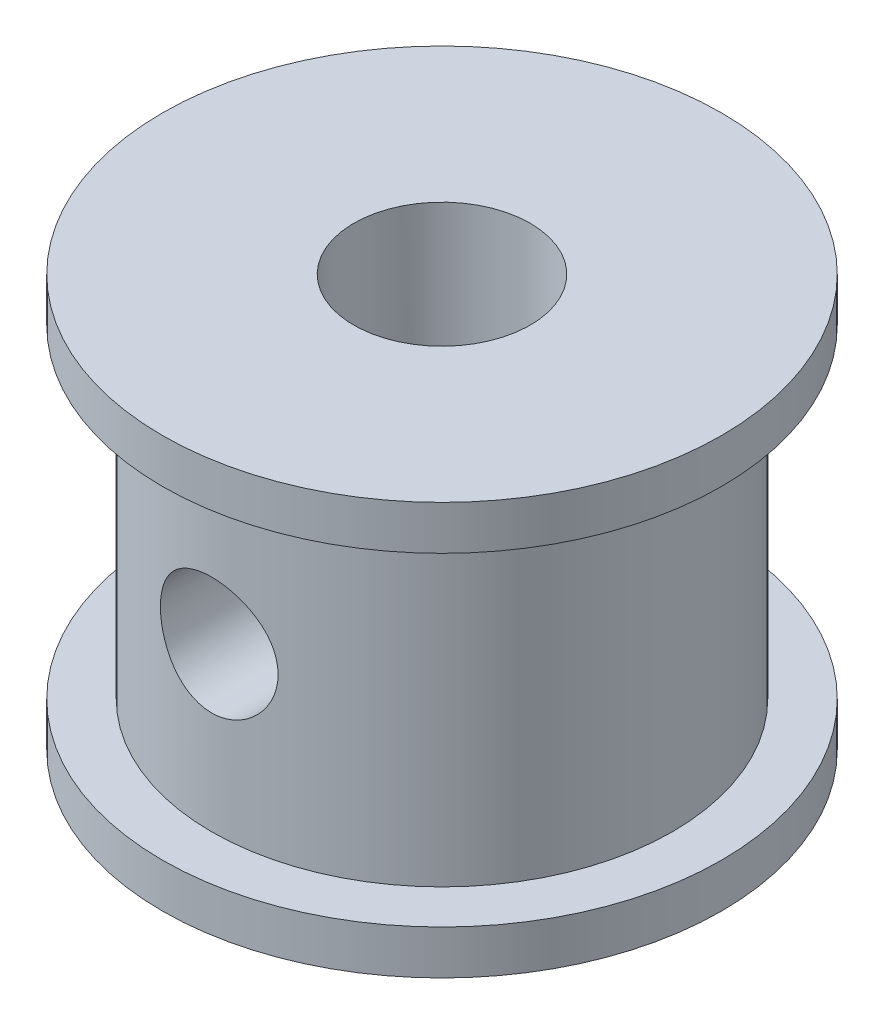
ISO-10303-21;
HEADER;
FILE_DESCRIPTION(('STEP AP214'),'2;1');
FILE_NAME('part.step','',(''),(''),'','','');
FILE_SCHEMA(('AUTOMOTIVE_DESIGN { 1 0 10303 214 1 1 1 1 }'));
ENDSEC;
DATA;
#1=APPLICATION_CONTEXT('core data for automotive mechanical design processes');
#2=APPLICATION_PROTOCOL_DEFINITION('international standard','automotive_design',2000,#1);
#3=PRODUCT_CONTEXT('',#1,'mechanical');
#4=PRODUCT('Part','Part','',(#3));
#5=PRODUCT_RELATED_PRODUCT_CATEGORY('part','',(#4));
#6=PRODUCT_DEFINITION_FORMATION('','',#4);
#7=PRODUCT_DEFINITION_CONTEXT('part definition',#1,'design');
#8=PRODUCT_DEFINITION('design','',#6,#7);
#9=PRODUCT_DEFINITION_SHAPE('','',#8);
#10=(LENGTH_UNIT() NAMED_UNIT(*) SI_UNIT(.MILLI.,.METRE.));
#11=(NAMED_UNIT(*) PLANE_ANGLE_UNIT() SI_UNIT($,.RADIAN.));
#12=(NAMED_UNIT(*) SI_UNIT($,.STERADIAN.) SOLID_ANGLE_UNIT());
#13=UNCERTAINTY_MEASURE_WITH_UNIT(LENGTH_MEASURE(1.E-05),#10,'distance_accuracy_value','');
#14=(GEOMETRIC_REPRESENTATION_CONTEXT(3) GLOBAL_UNCERTAINTY_ASSIGNED_CONTEXT((#13)) GLOBAL_UNIT_ASSIGNED_CONTEXT((#10,
#11,#12)) REPRESENTATION_CONTEXT('',''));
#15=CARTESIAN_POINT('',(0.,0.,0.));
#16=DIRECTION('',(0.,0.,1.));
#17=DIRECTION('',(1.,0.,0.));
#18=AXIS2_PLACEMENT_3D('',#15,#16,#17);
#19=CARTESIAN_POINT('',(0.,-5.5,0.));
#20=DIRECTION('',(0.,1.,0.));
#21=DIRECTION('',(0.,0.,1.));
#22=AXIS2_PLACEMENT_3D('',#19,#20,#21);
#23=CYLINDRICAL_SURFACE('',#22,7.83);
#24=CARTESIAN_POINT('',(-7.57026419618232,0.,-2.));
#25=CARTESIAN_POINT('',(-7.57026625113137,-0.110356362794923,-1.99999700894322));
#26=CARTESIAN_POINT('',(-7.57270365498595,-0.220745347586535,-1.99083498998717));
#27=CARTESIAN_POINT('',(-7.58216366301143,-0.43834755404925,-1.95449092309336));
#28=CARTESIAN_POINT('',(-7.58918881736881,-0.545558974741733,-1.92729885268692));
#29=CARTESIAN_POINT('',(-7.60697794193006,-0.753626988633069,-1.8558368642648));
#30=CARTESIAN_POINT('',(-7.61773694696175,-0.854491811990421,-1.81158961715049));
#31=CARTESIAN_POINT('',(-7.64177527659829,-1.04737918807853,-1.70734299084561));
#32=CARTESIAN_POINT('',(-7.655054736864,-1.13940126445593,-1.64734276370074));
#33=CARTESIAN_POINT('',(-7.68297919650331,-1.31410409338048,-1.51182113810645));
#34=CARTESIAN_POINT('',(-7.69764678771056,-1.39655180338595,-1.43600391649795));
#35=CARTESIAN_POINT('',(-7.72649917806867,-1.547710204927,-1.27163734975208));
#36=CARTESIAN_POINT('',(-7.7406839304431,-1.61641956864515,-1.18308677535091));
#37=CARTESIAN_POINT('',(-7.76722304596379,-1.73911017484842,-0.994164404656442));
#38=CARTESIAN_POINT('',(-7.77954764342751,-1.79286160366153,-0.89363881835594));
#39=CARTESIAN_POINT('',(-7.80071959024948,-1.88261483706627,-0.684611141346791));
#40=CARTESIAN_POINT('',(-7.80956747587152,-1.91861937923627,-0.576110283847273));
#41=CARTESIAN_POINT('',(-7.82262936162777,-1.9711078733964,-0.356642468206245));
#42=CARTESIAN_POINT('',(-7.82693722332135,-1.98798778902362,-0.245775893025707));
#43=CARTESIAN_POINT('',(-7.83076111416367,-2.00299169306133,-0.0227064617364563));
#44=CARTESIAN_POINT('',(-7.83027788161392,-2.00111857129053,0.0894961858236682));
#45=CARTESIAN_POINT('',(-7.82464355122231,-1.97895246070846,0.309303374265251));
#46=CARTESIAN_POINT('',(-7.81960080046056,-1.95908700229542,0.416954225950234));
#47=CARTESIAN_POINT('',(-7.80554073651134,-1.90218844093851,0.627340728428714));
#48=CARTESIAN_POINT('',(-7.79652320667821,-1.86515440221406,0.730076110965761));
#49=CARTESIAN_POINT('',(-7.77536266643169,-1.77462988562932,0.928830578034148));
#50=CARTESIAN_POINT('',(-7.76319127679051,-1.7209890745182,1.0247780464016));
#51=CARTESIAN_POINT('',(-7.73704048634229,-1.5988881379628,1.20645822430819));
#52=CARTESIAN_POINT('',(-7.72306075891494,-1.53042533387514,1.29218908314513));
#53=CARTESIAN_POINT('',(-7.69434843791771,-1.37833900716413,1.4535529698114));
#54=CARTESIAN_POINT('',(-7.67960573170857,-1.29434209894546,1.52883266865154));
#55=CARTESIAN_POINT('',(-7.65138851063657,-1.11476239320487,1.66431868164877));
#56=CARTESIAN_POINT('',(-7.63791406054161,-1.01917900454879,1.72452422625223));
#57=CARTESIAN_POINT('',(-7.61372133210612,-0.818423303363618,1.82839261356447));
#58=CARTESIAN_POINT('',(-7.60301790070651,-0.713203266762768,1.87196691418658));
#59=CARTESIAN_POINT('',(-7.58576749764737,-0.496590867662067,1.94069595516282));
#60=CARTESIAN_POINT('',(-7.5792195920454,-0.385199898184937,1.96585483452483));
#61=CARTESIAN_POINT('',(-7.57121859249028,-0.162693199732289,1.99644536796081));
#62=CARTESIAN_POINT('',(-7.56963023253783,-0.0516542777283941,2.00240092256245));
#63=CARTESIAN_POINT('',(-7.57135936275847,0.169831538949728,1.99585296324565));
#64=CARTESIAN_POINT('',(-7.57467637914633,0.280278489765411,1.98335123202239));
#65=CARTESIAN_POINT('',(-7.58571256569704,0.495476583227604,1.94070375717033));
#66=CARTESIAN_POINT('',(-7.59335478927816,0.600293123045987,1.91086618248411));
#67=CARTESIAN_POINT('',(-7.61210657265173,0.803435916862879,1.83473721128827));
#68=CARTESIAN_POINT('',(-7.62321655688562,0.901761374590525,1.78844380054706));
#69=CARTESIAN_POINT('',(-7.64793455181796,1.09134180358515,1.67963125767167));
#70=CARTESIAN_POINT('',(-7.66158885703818,1.18241184367724,1.61680067856786));
#71=CARTESIAN_POINT('',(-7.68974492359963,1.35290842151294,1.4770886462555));
#72=CARTESIAN_POINT('',(-7.7042468303043,1.43233295381139,1.40020477807302));
#73=CARTESIAN_POINT('',(-7.73292484496928,1.57942291183955,1.232158191347));
#74=CARTESIAN_POINT('',(-7.74708241105036,1.6467249773604,1.14067365958324));
#75=CARTESIAN_POINT('',(-7.77308364783108,1.76501277507527,0.947398539577612));
#76=CARTESIAN_POINT('',(-7.7849274404072,1.81599936676636,0.84560849460087));
#77=CARTESIAN_POINT('',(-7.80489125353461,1.89975720235788,0.635321575362334));
#78=CARTESIAN_POINT('',(-7.8130383682787,1.93266136722444,0.526880338492071));
#79=CARTESIAN_POINT('',(-7.82480969678913,1.9797154169596,0.305770789494863));
#80=CARTESIAN_POINT('',(-7.82843482441698,1.99386909120521,0.193103336198653));
#81=CARTESIAN_POINT('',(-7.83071455077001,2.0027994386567,-0.0298529939103351));
#82=CARTESIAN_POINT('',(-7.82950643628764,1.99811129054583,-0.140119348310511));
#83=CARTESIAN_POINT('',(-7.82256178748259,1.97072225109619,-0.358238273068338));
#84=CARTESIAN_POINT('',(-7.816825398793,1.94802193904361,-0.466090920938106));
#85=CARTESIAN_POINT('',(-7.80149193176178,1.88554511522963,-0.675733939439828));
#86=CARTESIAN_POINT('',(-7.79191761067315,1.84586916971505,-0.777556053954113));
#87=CARTESIAN_POINT('',(-7.76991414489985,1.7506579863391,-0.973155920312975));
#88=CARTESIAN_POINT('',(-7.75748462683737,1.695120674035,-1.06693261784311));
#89=CARTESIAN_POINT('',(-7.73072209268023,1.56815210859897,-1.24630278120913));
#90=CARTESIAN_POINT('',(-7.71634946689868,1.49636035748154,-1.3316351516247));
#91=CARTESIAN_POINT('',(-7.68749289112827,1.33961555652626,-1.48922298315244));
#92=CARTESIAN_POINT('',(-7.67300891353901,1.25465913663091,-1.56147508551515));
#93=CARTESIAN_POINT('',(-7.64524349076823,1.07198208014858,-1.69225284257135));
#94=CARTESIAN_POINT('',(-7.63199135897533,0.97404294641367,-1.75048002337148));
#95=CARTESIAN_POINT('',(-7.60859045393782,0.769440361762994,-1.84955691760859));
#96=CARTESIAN_POINT('',(-7.5984394958896,0.662783120289493,-1.89041887296989));
#97=CARTESIAN_POINT('',(-7.58392076158657,0.463647261530005,-1.94775451036689));
#98=CARTESIAN_POINT('',(-7.57883899577284,0.37209407077878,-1.96730283198592));
#99=CARTESIAN_POINT('',(-7.57200999867679,0.187034941348459,-1.99342623576357));
#100=CARTESIAN_POINT('',(-7.57026245457262,0.0935291866941881,-2.00000253497942));
#101=CARTESIAN_POINT('',(-7.57026419618232,0.,-2.));
#102=B_SPLINE_CURVE_WITH_KNOTS('',3,(#24,#25,#26,#27,#28,#29,#30,#31,#32,#33,#34,#35,#36,#37,
#38,#39,#40,#41,#42,#43,#44,#45,#46,#47,#48,#49,#50,#51,#52,#53,#54,#55,#56,#57,#58,#59,#60,#61,
#62,#63,#64,#65,#66,#67,#68,#69,#70,#71,#72,#73,#74,#75,#76,#77,#78,#79,#80,#81,#82,#83,#84,#85,
#86,#87,#88,#89,#90,#91,#92,#93,#94,#95,#96,#97,#98,#99,#100,#101),.UNSPECIFIED.,.T.,.F.,(4,2,2,
2,2,2,2,2,2,2,2,2,2,2,2,2,2,2,2,2,2,2,2,2,2,2,2,2,2,2,2,2,2,2,2,2,2,2,4),(0.,0.330725478391877,
0.661634953359049,0.992106069473404,1.32259497789607,1.6599312030025,1.99730001606574,
2.33959717593098,2.681841517586,3.01686243570472,3.35183172832991,3.67904455186287,
4.00627521236341,4.33655931779794,4.66690316236142,5.00657140792717,5.34625699042944,
5.6877265845317,6.02911940712472,6.36111595691296,6.69308044294401,7.01931689452787,
7.34559329195001,7.67851907666667,8.01150212657251,8.35322504489832,8.69492995833985,
9.03408825973904,9.37317800854142,9.7027053749251,10.0322221438639,10.3598132611352,
10.6874472423329,11.023218664826,11.3590761847443,11.7015505549,12.0437830895401,
12.3241057349986,12.604402078858),.UNSPECIFIED.);
#103=CARTESIAN_POINT('',(-7.57026419618232,0.,-2.));
#104=VERTEX_POINT('',#103);
#105=EDGE_CURVE('E61',#104,#104,#102,.T.);
#106=ORIENTED_EDGE('',*,*,#105,.F.);
#107=EDGE_LOOP('',(#106));
#108=FACE_BOUND('',#107,.T.);
#109=CARTESIAN_POINT('',(0.,5.5,0.));
#110=DIRECTION('',(0.,1.,0.));
#111=DIRECTION('',(0.,0.,1.));
#112=AXIS2_PLACEMENT_3D('',#109,#110,#111);
#113=CIRCLE('',#112,7.83);
#114=CARTESIAN_POINT('',(0.,5.5,7.83));
#115=VERTEX_POINT('',#114);
#116=EDGE_CURVE('E10',#115,#115,#113,.T.);
#117=ORIENTED_EDGE('',*,*,#116,.F.);
#118=EDGE_LOOP('',(#117));
#119=FACE_BOUND('',#118,.T.);
#120=CARTESIAN_POINT('',(0.,-5.5,0.));
#121=DIRECTION('',(0.,1.,0.));
#122=DIRECTION('',(0.,0.,1.));
#123=AXIS2_PLACEMENT_3D('',#120,#121,#122);
#124=CIRCLE('',#123,7.83);
#125=CARTESIAN_POINT('',(0.,-5.5,7.83));
#126=VERTEX_POINT('',#125);
#127=EDGE_CURVE('E44',#126,#126,#124,.T.);
#128=ORIENTED_EDGE('',*,*,#127,.T.);
#129=EDGE_LOOP('',(#128));
#130=FACE_BOUND('',#129,.T.);
#131=CARTESIAN_POINT('',(0.,-2.,7.83));
#132=CARTESIAN_POINT('',(-0.110422630526224,-1.99999704655956,7.82999818920487));
#133=CARTESIAN_POINT('',(-0.220877805593165,-1.99082439986723,7.82764096435587));
#134=CARTESIAN_POINT('',(-0.438617308546014,-1.95443429976299,7.81846609838671));
#135=CARTESIAN_POINT('',(-0.545899893438622,-1.92720711290407,7.81164605132482));
#136=CARTESIAN_POINT('',(-0.754118857571174,-1.85564250941325,7.79429997085119));
#137=CARTESIAN_POINT('',(-0.855062861451803,-1.81132612622696,7.78377849456287));
#138=CARTESIAN_POINT('',(-1.04808443201088,-1.70691638670761,7.76014734098983));
#139=CARTESIAN_POINT('',(-1.14016160486808,-1.64682233004881,7.74703754882359));
#140=CARTESIAN_POINT('',(-1.31480866606515,-1.51120322178782,7.71933643415481));
#141=CARTESIAN_POINT('',(-1.39716150272941,-1.43540347646041,7.70472145647029));
#142=CARTESIAN_POINT('',(-1.54813496851945,-1.27111249373466,7.67581262731283));
#143=CARTESIAN_POINT('',(-1.61675397991676,-1.18261976331503,7.66151881384614));
#144=CARTESIAN_POINT('',(-1.73934469367368,-0.993754426487982,7.63463112812684));
#145=CARTESIAN_POINT('',(-1.79307139571595,-0.893218136533942,7.6220672283416));
#146=CARTESIAN_POINT('',(-1.88277603686673,-0.684167565902569,7.6004077894849));
#147=CARTESIAN_POINT('',(-1.9187569510196,-0.575654626001358,7.59131166910554));
#148=CARTESIAN_POINT('',(-1.97120392287247,-0.356123285612949,7.57786116329596));
#149=CARTESIAN_POINT('',(-1.98806129778428,-0.24520432594279,7.57341184901961));
#150=CARTESIAN_POINT('',(-2.00300192231294,-0.0220303549506709,7.56947474408108));
#151=CARTESIAN_POINT('',(-2.00108836951178,0.0902244255635169,7.56998610837919));
#152=CARTESIAN_POINT('',(-1.97885317682231,0.309866957093479,7.57582736669079));
#153=CARTESIAN_POINT('',(-1.95900011386275,0.417305918417863,7.58103459852507));
#154=CARTESIAN_POINT('',(-1.90219789718328,0.627275299053864,7.59548509286735));
#155=CARTESIAN_POINT('',(-1.86524747801098,0.729805354415284,7.60472865411942));
#156=CARTESIAN_POINT('',(-1.77490573406429,0.928291725467949,7.62632136174363));
#157=CARTESIAN_POINT('',(-1.7213462050114,1.0241679086814,7.63870203233622));
#158=CARTESIAN_POINT('',(-1.59942414067966,1.20573888597005,7.66515644555104));
#159=CARTESIAN_POINT('',(-1.53105891091145,1.29143182239409,7.67923049614403));
#160=CARTESIAN_POINT('',(-1.37904888996602,1.45288650010667,7.70800047514639));
#161=CARTESIAN_POINT('',(-1.29500928674836,1.52827593505789,7.72270243346977));
#162=CARTESIAN_POINT('',(-1.11530285181851,1.66396393604906,7.75069394211386));
#163=CARTESIAN_POINT('',(-1.01963563372873,1.72426200040944,7.76398344547215));
#164=CARTESIAN_POINT('',(-0.818843954800023,1.82820094134587,7.78772362621454));
#165=CARTESIAN_POINT('',(-0.713685701847834,1.87177914577771,7.79816358107495));
#166=CARTESIAN_POINT('',(-0.497209355913703,1.94053421509965,7.81495055954834));
#167=CARTESIAN_POINT('',(-0.385892499317263,1.96571475914048,7.8212984014692));
#168=CARTESIAN_POINT('',(-0.163440113005464,1.99638604557359,7.82906397900243));
#169=CARTESIAN_POINT('',(-0.0523787757308779,2.0023835259419,7.8306085656761));
#170=CARTESIAN_POINT('',(0.169161327799448,1.99591134011798,7.82895598242322));
#171=CARTESIAN_POINT('',(0.279640147973327,1.98344341431511,7.82575925937147));
#172=CARTESIAN_POINT('',(0.495103007865317,1.94081140495334,7.8150647455942));
#173=CARTESIAN_POINT('',(0.600145804151708,1.91092574686989,7.80763466673959));
#174=CARTESIAN_POINT('',(0.803720158476011,1.83462632988721,7.78931248207026));
#175=CARTESIAN_POINT('',(0.902251041445739,1.78821086057437,7.77842001799958));
#176=CARTESIAN_POINT('',(1.09200577046848,1.67920081893165,7.75407955980069));
#177=CARTESIAN_POINT('',(1.18306238049091,1.61632502320342,7.74058834449847));
#178=CARTESIAN_POINT('',(1.35351137429376,1.47653669178641,7.71261176399428));
#179=CARTESIAN_POINT('',(1.43290164735932,1.39962162169265,7.69812621958859));
#180=CARTESIAN_POINT('',(1.5798677795327,1.23158119424616,7.66933370608642));
#181=CARTESIAN_POINT('',(1.6470874762903,1.14014137257057,7.65504089947522));
#182=CARTESIAN_POINT('',(1.76523048436696,0.946982518239838,7.6286656581981));
#183=CARTESIAN_POINT('',(1.81615450977934,0.8452639362678,7.61658312668555));
#184=CARTESIAN_POINT('',(1.8998789125708,0.634971214993447,7.59613180265512));
#185=CARTESIAN_POINT('',(1.93278633244902,0.526441932650245,7.58774113539298));
#186=CARTESIAN_POINT('',(1.97981727623335,0.305142701845323,7.57560721031246));
#187=CARTESIAN_POINT('',(1.99394512507865,0.192373735937405,7.57186288245434));
#188=CARTESIAN_POINT('',(2.0027825055195,-0.0305725723935869,7.56952967090976));
#189=CARTESIAN_POINT('',(1.99806227557062,-0.140726080580983,7.57078938652463));
#190=CARTESIAN_POINT('',(1.97064821249808,-0.358610541281617,7.57797086328903));
#191=CARTESIAN_POINT('',(1.94795477178519,-0.466341546632772,7.58389252265389));
#192=CARTESIAN_POINT('',(1.88555616243737,-0.67567175202499,7.59964442066747));
#193=CARTESIAN_POINT('',(1.84596238177574,-0.777306216955304,7.60944903722616));
#194=CARTESIAN_POINT('',(1.75097449525595,-0.972563807898891,7.63186472212034));
#195=CARTESIAN_POINT('',(1.69557810384492,-1.06618577250528,7.64447619635741));
#196=CARTESIAN_POINT('',(1.56878880755664,-1.24550566585595,7.67151254262771));
#197=CARTESIAN_POINT('',(1.49700230235573,-1.33091931705495,7.68597736341011));
#198=CARTESIAN_POINT('',(1.34023167869315,-1.48867344394051,7.71485713771899));
#199=CARTESIAN_POINT('',(1.25524440875352,-1.56101078891533,7.72927207849511));
#200=CARTESIAN_POINT('',(1.07252197491896,-1.69191223042712,7.75675731321517));
#201=CARTESIAN_POINT('',(0.974573994466496,-1.75018628348959,7.76979659862906));
#202=CARTESIAN_POINT('',(0.769945679916667,-1.84934856527723,7.79273054708435));
#203=CARTESIAN_POINT('',(0.663271458197068,-1.89024884135478,7.80262738795826));
#204=CARTESIAN_POINT('',(0.464042537591199,-1.94766473379426,7.81675627936552));
#205=CARTESIAN_POINT('',(0.372409186063591,-1.96724704609663,7.82168790583208));
#206=CARTESIAN_POINT('',(0.187191578115762,-1.99341539660064,7.82831040040387));
#207=CARTESIAN_POINT('',(0.0936074827890929,-2.00000250369081,7.83000153504742));
#208=CARTESIAN_POINT('',(0.,-2.,7.83));
#209=B_SPLINE_CURVE_WITH_KNOTS('',3,(#131,#132,#133,#134,#135,#136,#137,#138,#139,#140,#141,
#142,#143,#144,#145,#146,#147,#148,#149,#150,#151,#152,#153,#154,#155,#156,#157,#158,#159,#160,
#161,#162,#163,#164,#165,#166,#167,#168,#169,#170,#171,#172,#173,#174,#175,#176,#177,#178,#179,
#180,#181,#182,#183,#184,#185,#186,#187,#188,#189,#190,#191,#192,#193,#194,#195,#196,#197,#198,
#199,#200,#201,#202,#203,#204,#205,#206,#207,#208),.UNSPECIFIED.,.T.,.F.,(4,2,2,2,2,2,2,2,2,2,2,
2,2,2,2,2,2,2,2,2,2,2,2,2,2,2,2,2,2,2,2,2,2,2,2,2,2,2,4),(0.,0.330924776840336,
0.662028104911757,0.992725203850997,1.32343698396971,1.6605128399744,1.99762837732711,
2.33999896450762,2.68231213444556,3.01748666543337,3.35260410124454,3.67921359312002,
4.0058472627036,4.33590325810566,4.6660193709486,5.0059786061401,5.34594914103122,
5.68718184171679,6.02834628424373,6.36042076668901,6.69246395265946,7.01933954403095,
7.34624896851616,7.67915641290416,8.01212401412124,8.35365088168403,8.69516278113309,
9.0346229984185,9.37400502439153,9.70319820625048,10.0323842010026,10.3594332839264,
10.6865296924025,11.0225100149086,11.3585706711415,11.7010619734867,12.0433153957378,
12.3238700561401,12.604401639249),.UNSPECIFIED.);
#210=CARTESIAN_POINT('',(0.,-2.,7.83));
#211=VERTEX_POINT('',#210);
#212=EDGE_CURVE('E60',#211,#211,#209,.T.);
#213=ORIENTED_EDGE('',*,*,#212,.T.);
#214=EDGE_LOOP('',(#213));
#215=FACE_BOUND('',#214,.T.);
#216=ADVANCED_FACE('F31',(#108,#119,#130,#215),#23,.T.);
#217=CARTESIAN_POINT('',(0.,7.,0.));
#218=DIRECTION('',(0.,-1.,0.));
#219=DIRECTION('',(0.,0.,-1.));
#220=AXIS2_PLACEMENT_3D('',#217,#218,#219);
#221=CYLINDRICAL_SURFACE('',#220,3.);
#222=CARTESIAN_POINT('',(-2.23606797749979,0.,-2.));
#223=CARTESIAN_POINT('',(-2.23607753462816,-0.0976283108686205,-1.99999453997731));
#224=CARTESIAN_POINT('',(-2.24258071047442,-0.195290753708801,-1.99278992503664));
#225=CARTESIAN_POINT('',(-2.26731972501617,-0.387119911650814,-1.96458268317731));
#226=CARTESIAN_POINT('',(-2.2855766081271,-0.481280035529566,-1.94355530587862));
#227=CARTESIAN_POINT('',(-2.3305658582557,-0.662735441877684,-1.88935861676632));
#228=CARTESIAN_POINT('',(-2.35721561794601,-0.750087696737658,-1.85630718014214));
#229=CARTESIAN_POINT('',(-2.41584094681825,-0.917865832346665,-1.77934008393538));
#230=CARTESIAN_POINT('',(-2.44781762158831,-0.998290269976474,-1.73542216812163));
#231=CARTESIAN_POINT('',(-2.51946072932026,-1.16364688761691,-1.63002410007714));
#232=CARTESIAN_POINT('',(-2.55954936090364,-1.2473321177172,-1.56687435451732));
#233=CARTESIAN_POINT('',(-2.63944827308082,-1.40400270887428,-1.4281921974068));
#234=CARTESIAN_POINT('',(-2.67925824297985,-1.47697752165853,-1.3526477317708));
#235=CARTESIAN_POINT('',(-2.76088818523747,-1.62064365878166,-1.17815690494295));
#236=CARTESIAN_POINT('',(-2.80216785846923,-1.68948251177567,-1.07740643965819));
#237=CARTESIAN_POINT('',(-2.87558484482764,-1.80864209549007,-0.862470964212232));
#238=CARTESIAN_POINT('',(-2.90773236231037,-1.85898351403119,-0.748301152321704));
#239=CARTESIAN_POINT('',(-2.95599907464725,-1.93355640101745,-0.523249073480003));
#240=CARTESIAN_POINT('',(-2.97351175615867,-1.96008334449556,-0.413434725181416));
#241=CARTESIAN_POINT('',(-2.99609745461921,-1.99418448928365,-0.189695448729862));
#242=CARTESIAN_POINT('',(-3.00118613762359,-2.00178255922544,-0.0757758812858254));
#243=CARTESIAN_POINT('',(-2.99855361722953,-1.99782755005095,0.134147050232329));
#244=CARTESIAN_POINT('',(-2.99266264910127,-1.98901094868294,0.230240638008752));
#245=CARTESIAN_POINT('',(-2.9720818279002,-1.95790894864109,0.419238633271015));
#246=CARTESIAN_POINT('',(-2.95739133313102,-1.93562256769646,0.512142807649723));
#247=CARTESIAN_POINT('',(-2.92052091703736,-1.87880431520542,0.692077937671169));
#248=CARTESIAN_POINT('',(-2.89837077982679,-1.84432111480144,0.779130623845961));
#249=CARTESIAN_POINT('',(-2.84821104476287,-1.76444635704718,0.946209150653556));
#250=CARTESIAN_POINT('',(-2.82020037745161,-1.71905280849849,1.0262337049694));
#251=CARTESIAN_POINT('',(-2.75618058450702,-1.61202126254011,1.18828429196344));
#252=CARTESIAN_POINT('',(-2.71960408792025,-1.54903247664721,1.26919148099708));
#253=CARTESIAN_POINT('',(-2.64400601826998,-1.41210132051968,1.41998807498305));
#254=CARTESIAN_POINT('',(-2.60498072815232,-1.33814205406619,1.48986013519457));
#255=CARTESIAN_POINT('',(-2.52150044944151,-1.16803678978671,1.62772235326165));
#256=CARTESIAN_POINT('',(-2.47714320008931,-1.07022892028551,1.69373593126354));
#257=CARTESIAN_POINT('',(-2.39475610831095,-0.862490160779288,1.80834874945482));
#258=CARTESIAN_POINT('',(-2.35671571534889,-0.752580005586103,1.85697718654898));
#259=CARTESIAN_POINT('',(-2.30262870306889,-0.555280937926898,1.92332724567776));
#260=CARTESIAN_POINT('',(-2.28340364577667,-0.470406629943127,1.94590791747533));
#261=CARTESIAN_POINT('',(-2.25409039789612,-0.296960510183163,1.97979555580014));
#262=CARTESIAN_POINT('',(-2.24398636782354,-0.208395388827382,1.99112206964395));
#263=CARTESIAN_POINT('',(-2.23447556987372,-0.0295570135585068,2.00179400148877));
#264=CARTESIAN_POINT('',(-2.2351153386647,0.0607219785201222,2.00108729753098));
#265=CARTESIAN_POINT('',(-2.24709880368953,0.239683833955043,1.98761629716365));
#266=CARTESIAN_POINT('',(-2.2584511764885,0.328365344107383,1.97484222690381));
#267=CARTESIAN_POINT('',(-2.28927977500746,0.497389417549837,1.93899811187046));
#268=CARTESIAN_POINT('',(-2.30833187069749,0.577927709002576,1.91646174529973));
#269=CARTESIAN_POINT('',(-2.3522995853365,0.734126236050296,1.86223041628513));
#270=CARTESIAN_POINT('',(-2.3772171729463,0.809784822963012,1.83053237805351));
#271=CARTESIAN_POINT('',(-2.43611483596194,0.970202003847518,1.75163346599563));
#272=CARTESIAN_POINT('',(-2.47091081434316,1.05375681154269,1.70260028818246));
#273=CARTESIAN_POINT('',(-2.54262514806633,1.21241680261729,1.59352731501438));
#274=CARTESIAN_POINT('',(-2.57954604947543,1.28751151674245,1.53347411883827));
#275=CARTESIAN_POINT('',(-2.66075678321007,1.44396234746754,1.38876657712435));
#276=CARTESIAN_POINT('',(-2.70489452138573,1.52310284824832,1.30160386514207));
#277=CARTESIAN_POINT('',(-2.78775581841638,1.66581668294029,1.11309948866219));
#278=CARTESIAN_POINT('',(-2.82648414789457,1.72940377125672,1.011770477457));
#279=CARTESIAN_POINT('',(-2.88790821242221,1.82789173891759,0.817487474821799));
#280=CARTESIAN_POINT('',(-2.91225458111008,1.86595650444036,0.726662364886323));
#281=CARTESIAN_POINT('',(-2.95278707867041,1.92860719432044,0.538757079020518));
#282=CARTESIAN_POINT('',(-2.96898009871993,1.95320450285977,0.441682263858772));
#283=CARTESIAN_POINT('',(-2.99178364026746,1.98769696383875,0.243369392303445));
#284=CARTESIAN_POINT('',(-2.99835150856532,1.99752667950668,0.142114836924321));
#285=CARTESIAN_POINT('',(-3.00109821029056,2.0016478514171,-0.0608555465807293));
#286=CARTESIAN_POINT('',(-2.99727800938901,1.99594075195618,-0.162571330953445));
#287=CARTESIAN_POINT('',(-2.98029555977323,1.9703405109953,-0.355757532528105));
#288=CARTESIAN_POINT('',(-2.96783277209856,1.95150901513819,-0.447435143070529));
#289=CARTESIAN_POINT('',(-2.93536106206933,1.9017619905691,-0.626018422997061));
#290=CARTESIAN_POINT('',(-2.91535096747103,1.87084458465274,-0.712923348686889));
#291=CARTESIAN_POINT('',(-2.86791765486194,1.79606129511597,-0.885147296608349));
#292=CARTESIAN_POINT('',(-2.84013248946338,1.75154969250492,-0.970083589200263));
#293=CARTESIAN_POINT('',(-2.77975408235472,1.65184935537402,-1.13155266268318));
#294=CARTESIAN_POINT('',(-2.74715796645263,1.596654232048,-1.20808037205002));
#295=CARTESIAN_POINT('',(-2.67392931472394,1.46737109766369,-1.36329422201402));
#296=CARTESIAN_POINT('',(-2.6328391387737,1.39167697632596,-1.44042679526091));
#297=CARTESIAN_POINT('',(-2.55053357649486,1.22888645845416,-1.58160022281595));
#298=CARTESIAN_POINT('',(-2.50931811970154,1.14178161116591,-1.64563128323923));
#299=CARTESIAN_POINT('',(-2.43384213590298,0.964132409244709,-1.75513253518411));
#300=CARTESIAN_POINT('',(-2.39929086741904,0.874358190049658,-1.8016464689721));
#301=CARTESIAN_POINT('',(-2.33747501591022,0.686715551006842,-1.88115802340272));
#302=CARTESIAN_POINT('',(-2.31019631295305,0.588863306137848,-1.91418190281333));
#303=CARTESIAN_POINT('',(-2.27191051929539,0.409228531575451,-1.95936262470908));
#304=CARTESIAN_POINT('',(-2.25863695410151,0.328691763209702,-1.97452228373248));
#305=CARTESIAN_POINT('',(-2.24071519216008,0.165443599495463,-1.99483915818926));
#306=CARTESIAN_POINT('',(-2.23605987841475,0.0827340557394219,-2.00000462703715));
#307=CARTESIAN_POINT('',(-2.23606797749979,0.,-2.));
#308=B_SPLINE_CURVE_WITH_KNOTS('',3,(#222,#223,#224,#225,#226,#227,#228,#229,#230,#231,#232,
#233,#234,#235,#236,#237,#238,#239,#240,#241,#242,#243,#244,#245,#246,#247,#248,#249,#250,#251,
#252,#253,#254,#255,#256,#257,#258,#259,#260,#261,#262,#263,#264,#265,#266,#267,#268,#269,#270,
#271,#272,#273,#274,#275,#276,#277,#278,#279,#280,#281,#282,#283,#284,#285,#286,#287,#288,#289,
#290,#291,#292,#293,#294,#295,#296,#297,#298,#299,#300,#301,#302,#303,#304,#305,#306,#307),
.UNSPECIFIED.,.T.,.F.,(4,2,2,2,2,2,2,2,2,2,2,2,2,2,2,2,2,2,2,2,2,2,2,2,2,2,2,2,2,2,2,2,2,2,2,2,
2,2,2,2,2,2,4),(0.,0.292506930722153,0.585539042259288,0.875772651216274,1.16606657266549,
1.50154677068638,1.83735518436275,2.22167031006289,2.6055542938858,2.94637482063579,
3.28676536688298,3.57539534955742,3.86404638283746,4.15155831973191,4.43912276903,
4.76447525946635,5.09033414796638,5.46678703504944,5.84260469743948,6.11126090401324,
6.37944966235486,6.64880037638036,6.91836943570597,7.17476451706936,7.43124577644957,
7.73899230052351,8.04711556801509,8.42254684520963,8.7976449057258,9.10070580611698,
9.40351012888472,9.70765229266164,10.0117661844615,10.2937678224973,10.5758132789284,
10.874178629859,11.1727229593109,11.5182220628451,11.863978504186,12.1833412579672,
12.5020793664923,12.7501661630426,12.9980479966543),.UNSPECIFIED.);
#309=CARTESIAN_POINT('',(-2.23606797749979,0.,-2.));
#310=VERTEX_POINT('',#309);
#311=EDGE_CURVE('E35',#310,#310,#308,.T.);
#312=ORIENTED_EDGE('',*,*,#311,.T.);
#313=EDGE_LOOP('',(#312));
#314=FACE_BOUND('',#313,.T.);
#315=CARTESIAN_POINT('',(0.,7.,0.));
#316=DIRECTION('',(0.,-1.,0.));
#317=DIRECTION('',(0.,0.,-1.));
#318=AXIS2_PLACEMENT_3D('',#315,#316,#317);
#319=CIRCLE('',#318,3.);
#320=CARTESIAN_POINT('',(0.,7.,-3.));
#321=VERTEX_POINT('',#320);
#322=EDGE_CURVE('E84',#321,#321,#319,.T.);
#323=ORIENTED_EDGE('',*,*,#322,.F.);
#324=EDGE_LOOP('',(#323));
#325=FACE_BOUND('',#324,.T.);
#326=CARTESIAN_POINT('',(0.,-7.,0.));
#327=DIRECTION('',(0.,-1.,0.));
#328=DIRECTION('',(0.,0.,-1.));
#329=AXIS2_PLACEMENT_3D('',#326,#327,#328);
#330=CIRCLE('',#329,3.);
#331=CARTESIAN_POINT('',(0.,-7.,-3.));
#332=VERTEX_POINT('',#331);
#333=EDGE_CURVE('E80',#332,#332,#330,.T.);
#334=ORIENTED_EDGE('',*,*,#333,.T.);
#335=EDGE_LOOP('',(#334));
#336=FACE_BOUND('',#335,.T.);
#337=CARTESIAN_POINT('',(-2.,0.,2.23606797749979));
#338=CARTESIAN_POINT('',(-1.99999453997731,0.0976283108686206,2.23607753462816));
#339=CARTESIAN_POINT('',(-1.99278992503664,0.195290753708801,2.24258071047442));
#340=CARTESIAN_POINT('',(-1.96458268317731,0.387119911650814,2.26731972501617));
#341=CARTESIAN_POINT('',(-1.94355530587862,0.481280035529566,2.2855766081271));
#342=CARTESIAN_POINT('',(-1.88935861676632,0.662735441877684,2.3305658582557));
#343=CARTESIAN_POINT('',(-1.85630718014214,0.750087696737658,2.35721561794601));
#344=CARTESIAN_POINT('',(-1.77934008393538,0.917865832346664,2.41584094681825));
#345=CARTESIAN_POINT('',(-1.73542216812163,0.998290269976474,2.44781762158831));
#346=CARTESIAN_POINT('',(-1.63002410007714,1.16364688761691,2.51946072932026));
#347=CARTESIAN_POINT('',(-1.56687435451732,1.2473321177172,2.55954936090364));
#348=CARTESIAN_POINT('',(-1.4281921974068,1.40400270887428,2.63944827308082));
#349=CARTESIAN_POINT('',(-1.3526477317708,1.47697752165853,2.67925824297985));
#350=CARTESIAN_POINT('',(-1.17815690494295,1.62064365878166,2.76088818523747));
#351=CARTESIAN_POINT('',(-1.07740643965819,1.68948251177567,2.80216785846923));
#352=CARTESIAN_POINT('',(-0.862470964212231,1.80864209549007,2.87558484482764));
#353=CARTESIAN_POINT('',(-0.748301152321703,1.85898351403119,2.90773236231037));
#354=CARTESIAN_POINT('',(-0.523249073480002,1.93355640101745,2.95599907464725));
#355=CARTESIAN_POINT('',(-0.413434725181415,1.96008334449556,2.97351175615867));
#356=CARTESIAN_POINT('',(-0.189695448729861,1.99418448928365,2.99609745461921));
#357=CARTESIAN_POINT('',(-0.0757758812858239,2.00178255922544,3.00118613762359));
#358=CARTESIAN_POINT('',(0.13414705023233,1.99782755005095,2.99855361722953));
#359=CARTESIAN_POINT('',(0.230240638008754,1.98901094868294,2.99266264910127));
#360=CARTESIAN_POINT('',(0.419238633271016,1.95790894864109,2.9720818279002));
#361=CARTESIAN_POINT('',(0.512142807649725,1.93562256769646,2.95739133313102));
#362=CARTESIAN_POINT('',(0.692077937671169,1.87880431520542,2.92052091703736));
#363=CARTESIAN_POINT('',(0.779130623845962,1.84432111480144,2.89837077982679));
#364=CARTESIAN_POINT('',(0.946209150653556,1.76444635704718,2.84821104476287));
#365=CARTESIAN_POINT('',(1.0262337049694,1.71905280849849,2.82020037745161));
#366=CARTESIAN_POINT('',(1.18828429196344,1.61202126254011,2.75618058450702));
#367=CARTESIAN_POINT('',(1.26919148099708,1.54903247664721,2.71960408792025));
#368=CARTESIAN_POINT('',(1.41998807498305,1.41210132051968,2.64400601826998));
#369=CARTESIAN_POINT('',(1.48986013519457,1.33814205406619,2.60498072815232));
#370=CARTESIAN_POINT('',(1.62772235326165,1.16803678978671,2.52150044944151));
#371=CARTESIAN_POINT('',(1.69373593126354,1.07022892028551,2.47714320008931));
#372=CARTESIAN_POINT('',(1.80834874945482,0.862490160779287,2.39475610831095));
#373=CARTESIAN_POINT('',(1.85697718654898,0.752580005586101,2.35671571534889));
#374=CARTESIAN_POINT('',(1.92332724567776,0.555280937926897,2.30262870306889));
#375=CARTESIAN_POINT('',(1.94590791747533,0.470406629943126,2.28340364577667));
#376=CARTESIAN_POINT('',(1.97979555580014,0.296960510183162,2.25409039789612));
#377=CARTESIAN_POINT('',(1.99112206964395,0.208395388827381,2.24398636782354));
#378=CARTESIAN_POINT('',(2.00179400148877,0.029557013558505,2.23447556987372));
#379=CARTESIAN_POINT('',(2.00108729753098,-0.0607219785201239,2.2351153386647));
#380=CARTESIAN_POINT('',(1.98761629716365,-0.239683833955045,2.24709880368953));
#381=CARTESIAN_POINT('',(1.97484222690381,-0.328365344107386,2.2584511764885));
#382=CARTESIAN_POINT('',(1.93899811187046,-0.49738941754984,2.28927977500746));
#383=CARTESIAN_POINT('',(1.91646174529973,-0.577927709002578,2.30833187069749));
#384=CARTESIAN_POINT('',(1.86223041628513,-0.734126236050299,2.3522995853365));
#385=CARTESIAN_POINT('',(1.83053237805351,-0.809784822963014,2.3772171729463));
#386=CARTESIAN_POINT('',(1.75163346599563,-0.97020200384752,2.43611483596194));
#387=CARTESIAN_POINT('',(1.70260028818246,-1.0537568115427,2.47091081434316));
#388=CARTESIAN_POINT('',(1.59352731501438,-1.21241680261729,2.54262514806633));
#389=CARTESIAN_POINT('',(1.53347411883827,-1.28751151674245,2.57954604947543));
#390=CARTESIAN_POINT('',(1.38876657712435,-1.44396234746754,2.66075678321007));
#391=CARTESIAN_POINT('',(1.30160386514207,-1.52310284824832,2.70489452138573));
#392=CARTESIAN_POINT('',(1.11309948866219,-1.66581668294029,2.78775581841638));
#393=CARTESIAN_POINT('',(1.011770477457,-1.72940377125673,2.82648414789457));
#394=CARTESIAN_POINT('',(0.817487474821795,-1.82789173891759,2.88790821242222));
#395=CARTESIAN_POINT('',(0.726662364886319,-1.86595650444037,2.91225458111008));
#396=CARTESIAN_POINT('',(0.538757079020513,-1.92860719432044,2.95278707867041));
#397=CARTESIAN_POINT('',(0.441682263858767,-1.95320450285977,2.96898009871993));
#398=CARTESIAN_POINT('',(0.243369392303441,-1.98769696383875,2.99178364026746));
#399=CARTESIAN_POINT('',(0.142114836924316,-1.99752667950668,2.99835150856532));
#400=CARTESIAN_POINT('',(-0.0608555465807343,-2.0016478514171,3.00109821029056));
#401=CARTESIAN_POINT('',(-0.16257133095345,-1.99594075195618,2.99727800938901));
#402=CARTESIAN_POINT('',(-0.355757532528108,-1.9703405109953,2.98029555977323));
#403=CARTESIAN_POINT('',(-0.447435143070532,-1.95150901513819,2.96783277209856));
#404=CARTESIAN_POINT('',(-0.626018422997063,-1.9017619905691,2.93536106206933));
#405=CARTESIAN_POINT('',(-0.712923348686892,-1.87084458465274,2.91535096747102));
#406=CARTESIAN_POINT('',(-0.885147296608353,-1.79606129511597,2.86791765486194));
#407=CARTESIAN_POINT('',(-0.970083589200267,-1.75154969250492,2.84013248946338));
#408=CARTESIAN_POINT('',(-1.13155266268318,-1.65184935537401,2.77975408235471));
#409=CARTESIAN_POINT('',(-1.20808037205002,-1.596654232048,2.74715796645263));
#410=CARTESIAN_POINT('',(-1.36329422201402,-1.46737109766369,2.67392931472394));
#411=CARTESIAN_POINT('',(-1.44042679526091,-1.39167697632596,2.6328391387737));
#412=CARTESIAN_POINT('',(-1.58160022281596,-1.22888645845416,2.55053357649486));
#413=CARTESIAN_POINT('',(-1.64563128323923,-1.1417816111659,2.50931811970154));
#414=CARTESIAN_POINT('',(-1.75513253518411,-0.964132409244705,2.43384213590298));
#415=CARTESIAN_POINT('',(-1.8016464689721,-0.874358190049654,2.39929086741904));
#416=CARTESIAN_POINT('',(-1.88115802340272,-0.686715551006838,2.33747501591022));
#417=CARTESIAN_POINT('',(-1.91418190281333,-0.588863306137844,2.31019631295305));
#418=CARTESIAN_POINT('',(-1.95936262470908,-0.409228531575449,2.27191051929539));
#419=CARTESIAN_POINT('',(-1.97452228373248,-0.3286917632097,2.25863695410151));
#420=CARTESIAN_POINT('',(-1.99483915818926,-0.165443599495461,2.24071519216008));
#421=CARTESIAN_POINT('',(-2.00000462703715,-0.0827340557394213,2.23605987841475));
#422=CARTESIAN_POINT('',(-2.,0.,2.23606797749979));
#423=B_SPLINE_CURVE_WITH_KNOTS('',3,(#337,#338,#339,#340,#341,#342,#343,#344,#345,#346,#347,
#348,#349,#350,#351,#352,#353,#354,#355,#356,#357,#358,#359,#360,#361,#362,#363,#364,#365,#366,
#367,#368,#369,#370,#371,#372,#373,#374,#375,#376,#377,#378,#379,#380,#381,#382,#383,#384,#385,
#386,#387,#388,#389,#390,#391,#392,#393,#394,#395,#396,#397,#398,#399,#400,#401,#402,#403,#404,
#405,#406,#407,#408,#409,#410,#411,#412,#413,#414,#415,#416,#417,#418,#419,#420,#421,#422),
.UNSPECIFIED.,.T.,.F.,(4,2,2,2,2,2,2,2,2,2,2,2,2,2,2,2,2,2,2,2,2,2,2,2,2,2,2,2,2,2,2,2,2,2,2,2,
2,2,2,2,2,2,4),(0.,0.292506930722153,0.585539042259288,0.875772651216274,1.16606657266549,
1.50154677068638,1.83735518436275,2.22167031006289,2.6055542938858,2.9463748206358,
3.28676536688298,3.57539534955742,3.86404638283746,4.15155831973191,4.43912276903,
4.76447525946635,5.09033414796638,5.46678703504944,5.84260469743948,6.11126090401324,
6.37944966235486,6.64880037638036,6.91836943570598,7.17476451706936,7.43124577644957,
7.73899230052352,8.04711556801509,8.42254684520963,8.7976449057258,9.10070580611698,
9.40351012888472,9.70765229266165,10.0117661844615,10.2937678224973,10.5758132789284,
10.874178629859,11.1727229593109,11.5182220628451,11.863978504186,12.1833412579672,
12.5020793664923,12.7501661630426,12.9980479966543),.UNSPECIFIED.);
#424=CARTESIAN_POINT('',(-2.,0.,2.23606797749979));
#425=VERTEX_POINT('',#424);
#426=EDGE_CURVE('E54',#425,#425,#423,.T.);
#427=ORIENTED_EDGE('',*,*,#426,.F.);
#428=EDGE_LOOP('',(#427));
#429=FACE_BOUND('',#428,.T.);
#430=ADVANCED_FACE('F62',(#314,#325,#336,#429),#221,.F.);
#431=CARTESIAN_POINT('',(0.,-7.,0.));
#432=DIRECTION('',(0.,1.,0.));
#433=DIRECTION('',(0.,0.,1.));
#434=AXIS2_PLACEMENT_3D('',#431,#432,#433);
#435=CYLINDRICAL_SURFACE('',#434,9.5);
#436=CARTESIAN_POINT('',(0.,-7.,0.));
#437=DIRECTION('',(0.,-1.,0.));
#438=DIRECTION('',(0.,0.,-1.));
#439=AXIS2_PLACEMENT_3D('',#436,#437,#438);
#440=CIRCLE('',#439,9.5);
#441=CARTESIAN_POINT('',(0.,-7.,-9.5));
#442=VERTEX_POINT('',#441);
#443=EDGE_CURVE('E49',#442,#442,#440,.T.);
#444=ORIENTED_EDGE('',*,*,#443,.F.);
#445=EDGE_LOOP('',(#444));
#446=FACE_BOUND('',#445,.T.);
#447=CARTESIAN_POINT('',(0.,-5.5,0.));
#448=DIRECTION('',(0.,-1.,0.));
#449=DIRECTION('',(0.,0.,-1.));
#450=AXIS2_PLACEMENT_3D('',#447,#448,#449);
#451=CIRCLE('',#450,9.5);
#452=CARTESIAN_POINT('',(0.,-5.5,-9.5));
#453=VERTEX_POINT('',#452);
#454=EDGE_CURVE('E52',#453,#453,#451,.T.);
#455=ORIENTED_EDGE('',*,*,#454,.T.);
#456=EDGE_LOOP('',(#455));
#457=FACE_BOUND('',#456,.T.);
#458=ADVANCED_FACE('F100',(#446,#457),#435,.T.);
#459=CARTESIAN_POINT('',(0.,-7.,0.));
#460=DIRECTION('',(0.,-1.,0.));
#461=DIRECTION('',(0.,0.,-1.));
#462=AXIS2_PLACEMENT_3D('',#459,#460,#461);
#463=PLANE('',#462);
#464=ORIENTED_EDGE('',*,*,#333,.F.);
#465=EDGE_LOOP('',(#464));
#466=FACE_BOUND('',#465,.T.);
#467=ORIENTED_EDGE('',*,*,#443,.T.);
#468=EDGE_LOOP('',(#467));
#469=FACE_BOUND('',#468,.T.);
#470=ADVANCED_FACE('F105',(#466,#469),#463,.T.);
#471=CARTESIAN_POINT('',(0.,-5.5,0.));
#472=DIRECTION('',(0.,-1.,0.));
#473=DIRECTION('',(0.,0.,-1.));
#474=AXIS2_PLACEMENT_3D('',#471,#472,#473);
#475=PLANE('',#474);
#476=ORIENTED_EDGE('',*,*,#127,.F.);
#477=EDGE_LOOP('',(#476));
#478=FACE_BOUND('',#477,.T.);
#479=ORIENTED_EDGE('',*,*,#454,.F.);
#480=EDGE_LOOP('',(#479));
#481=FACE_BOUND('',#480,.T.);
#482=ADVANCED_FACE('F102',(#478,#481),#475,.F.);
#483=CARTESIAN_POINT('',(0.,7.,0.));
#484=DIRECTION('',(0.,-1.,0.));
#485=DIRECTION('',(0.,0.,-1.));
#486=AXIS2_PLACEMENT_3D('',#483,#484,#485);
#487=CYLINDRICAL_SURFACE('',#486,9.5);
#488=CARTESIAN_POINT('',(0.,7.,0.));
#489=DIRECTION('',(0.,1.,0.));
#490=DIRECTION('',(0.,0.,1.));
#491=AXIS2_PLACEMENT_3D('',#488,#489,#490);
#492=CIRCLE('',#491,9.5);
#493=CARTESIAN_POINT('',(0.,7.,9.5));
#494=VERTEX_POINT('',#493);
#495=EDGE_CURVE('E90',#494,#494,#492,.T.);
#496=ORIENTED_EDGE('',*,*,#495,.F.);
#497=EDGE_LOOP('',(#496));
#498=FACE_BOUND('',#497,.T.);
#499=CARTESIAN_POINT('',(0.,5.5,0.));
#500=DIRECTION('',(0.,1.,0.));
#501=DIRECTION('',(0.,0.,1.));
#502=AXIS2_PLACEMENT_3D('',#499,#500,#501);
#503=CIRCLE('',#502,9.5);
#504=CARTESIAN_POINT('',(0.,5.5,9.5));
#505=VERTEX_POINT('',#504);
#506=EDGE_CURVE('E87',#505,#505,#503,.T.);
#507=ORIENTED_EDGE('',*,*,#506,.T.);
#508=EDGE_LOOP('',(#507));
#509=FACE_BOUND('',#508,.T.);
#510=ADVANCED_FACE('F104',(#498,#509),#487,.T.);
#511=CARTESIAN_POINT('',(0.,7.,0.));
#512=DIRECTION('',(0.,1.,0.));
#513=DIRECTION('',(0.,0.,1.));
#514=AXIS2_PLACEMENT_3D('',#511,#512,#513);
#515=PLANE('',#514);
#516=ORIENTED_EDGE('',*,*,#322,.T.);
#517=EDGE_LOOP('',(#516));
#518=FACE_BOUND('',#517,.T.);
#519=ORIENTED_EDGE('',*,*,#495,.T.);
#520=EDGE_LOOP('',(#519));
#521=FACE_BOUND('',#520,.T.);
#522=ADVANCED_FACE('F112',(#518,#521),#515,.T.);
#523=CARTESIAN_POINT('',(0.,5.5,0.));
#524=DIRECTION('',(0.,1.,0.));
#525=DIRECTION('',(0.,0.,1.));
#526=AXIS2_PLACEMENT_3D('',#523,#524,#525);
#527=PLANE('',#526);
#528=ORIENTED_EDGE('',*,*,#116,.T.);
#529=EDGE_LOOP('',(#528));
#530=FACE_BOUND('',#529,.T.);
#531=ORIENTED_EDGE('',*,*,#506,.F.);
#532=EDGE_LOOP('',(#531));
#533=FACE_BOUND('',#532,.T.);
#534=ADVANCED_FACE('F69',(#530,#533),#527,.F.);
#535=CARTESIAN_POINT('',(0.,0.,9.5));
#536=DIRECTION('',(0.,0.,-1.));
#537=DIRECTION('',(-1.,0.,0.));
#538=AXIS2_PLACEMENT_3D('',#535,#536,#537);
#539=CYLINDRICAL_SURFACE('',#538,2.);
#540=ORIENTED_EDGE('',*,*,#212,.F.);
#541=EDGE_LOOP('',(#540));
#542=FACE_BOUND('',#541,.T.);
#543=ORIENTED_EDGE('',*,*,#426,.T.);
#544=EDGE_LOOP('',(#543));
#545=FACE_BOUND('',#544,.T.);
#546=ADVANCED_FACE('F65',(#542,#545),#539,.F.);
#547=CARTESIAN_POINT('',(-9.5,0.,0.));
#548=DIRECTION('',(1.,0.,0.));
#549=DIRECTION('',(0.,0.,-1.));
#550=AXIS2_PLACEMENT_3D('',#547,#548,#549);
#551=CYLINDRICAL_SURFACE('',#550,2.);
#552=ORIENTED_EDGE('',*,*,#105,.T.);
#553=EDGE_LOOP('',(#552));
#554=FACE_BOUND('',#553,.T.);
#555=ORIENTED_EDGE('',*,*,#311,.F.);
#556=EDGE_LOOP('',(#555));
#557=FACE_BOUND('',#556,.T.);
#558=ADVANCED_FACE('F68',(#554,#557),#551,.F.);
#559=CLOSED_SHELL('',(#216,#430,#458,#470,#482,#510,#522,#534,#546,#558));
#560=MANIFOLD_SOLID_BREP('B2',#559);
#561=ADVANCED_BREP_SHAPE_REPRESENTATION('',(#18,#560),#14);
#562=SHAPE_DEFINITION_REPRESENTATION(#9,#561);
ENDSEC;
END-ISO-10303-21;
